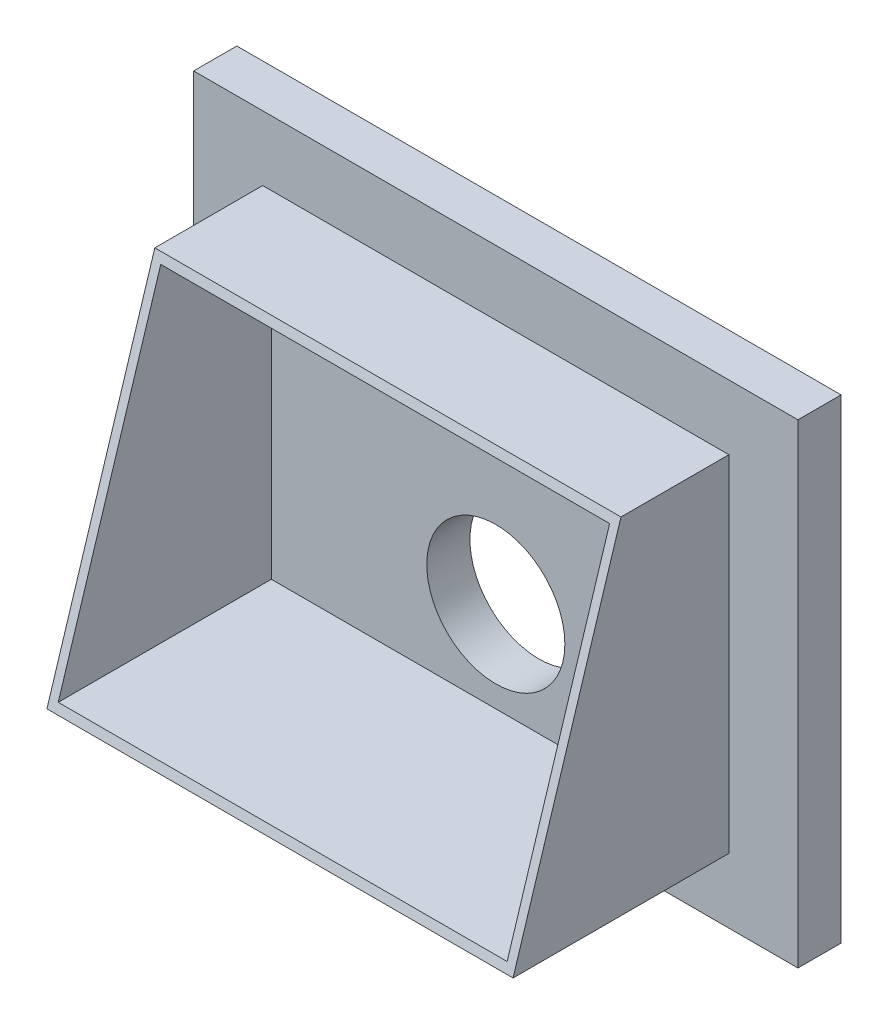
ISO-10303-21;
HEADER;
FILE_DESCRIPTION(('STEP AP214'),'2;1');
FILE_NAME('part.step','',(''),(''),'','','');
FILE_SCHEMA(('AUTOMOTIVE_DESIGN { 1 0 10303 214 1 1 1 1 }'));
ENDSEC;
DATA;
#1=APPLICATION_CONTEXT('core data for automotive mechanical design processes');
#2=APPLICATION_PROTOCOL_DEFINITION('international standard','automotive_design',2000,#1);
#3=PRODUCT_CONTEXT('',#1,'mechanical');
#4=PRODUCT('Part','Part','',(#3));
#5=PRODUCT_RELATED_PRODUCT_CATEGORY('part','',(#4));
#6=PRODUCT_DEFINITION_FORMATION('','',#4);
#7=PRODUCT_DEFINITION_CONTEXT('part definition',#1,'design');
#8=PRODUCT_DEFINITION('design','',#6,#7);
#9=PRODUCT_DEFINITION_SHAPE('','',#8);
#10=(LENGTH_UNIT() NAMED_UNIT(*) SI_UNIT(.MILLI.,.METRE.));
#11=(NAMED_UNIT(*) PLANE_ANGLE_UNIT() SI_UNIT($,.RADIAN.));
#12=(NAMED_UNIT(*) SI_UNIT($,.STERADIAN.) SOLID_ANGLE_UNIT());
#13=UNCERTAINTY_MEASURE_WITH_UNIT(LENGTH_MEASURE(1.E-05),#10,'distance_accuracy_value','');
#14=(GEOMETRIC_REPRESENTATION_CONTEXT(3) GLOBAL_UNCERTAINTY_ASSIGNED_CONTEXT((#13)) GLOBAL_UNIT_ASSIGNED_CONTEXT((#10,
#11,#12)) REPRESENTATION_CONTEXT('',''));
#15=CARTESIAN_POINT('',(0.,0.,0.));
#16=DIRECTION('',(0.,0.,1.));
#17=DIRECTION('',(1.,0.,0.));
#18=AXIS2_PLACEMENT_3D('',#15,#16,#17);
#19=CARTESIAN_POINT('',(0.,0.,50.));
#20=DIRECTION('',(0.,0.,-1.));
#21=DIRECTION('',(-1.,0.,0.));
#22=AXIS2_PLACEMENT_3D('',#19,#20,#21);
#23=PLANE('',#22);
#24=DIRECTION('',(0.,1.,0.));
#25=VECTOR('',#24,1.);
#26=CARTESIAN_POINT('',(350.,-275.,50.));
#27=LINE('',#26,#25);
#28=CARTESIAN_POINT('',(350.,-275.,50.));
#29=VERTEX_POINT('',#28);
#30=CARTESIAN_POINT('',(350.,275.,50.));
#31=VERTEX_POINT('',#30);
#32=EDGE_CURVE('E188',#29,#31,#27,.T.);
#33=ORIENTED_EDGE('',*,*,#32,.T.);
#34=DIRECTION('',(-1.,0.,0.));
#35=VECTOR('',#34,1.);
#36=CARTESIAN_POINT('',(-350.,275.,50.));
#37=LINE('',#36,#35);
#38=CARTESIAN_POINT('',(-350.,275.,50.));
#39=VERTEX_POINT('',#38);
#40=EDGE_CURVE('E192',#31,#39,#37,.T.);
#41=ORIENTED_EDGE('',*,*,#40,.T.);
#42=DIRECTION('',(0.,-1.,0.));
#43=VECTOR('',#42,1.);
#44=CARTESIAN_POINT('',(-350.,-275.,50.));
#45=LINE('',#44,#43);
#46=CARTESIAN_POINT('',(-350.,-275.,50.));
#47=VERTEX_POINT('',#46);
#48=EDGE_CURVE('E196',#39,#47,#45,.T.);
#49=ORIENTED_EDGE('',*,*,#48,.T.);
#50=DIRECTION('',(1.,0.,0.));
#51=VECTOR('',#50,1.);
#52=CARTESIAN_POINT('',(-350.,-275.,50.));
#53=LINE('',#52,#51);
#54=EDGE_CURVE('E199',#47,#29,#53,.T.);
#55=ORIENTED_EDGE('',*,*,#54,.T.);
#56=EDGE_LOOP('',(#33,#41,#49,#55));
#57=FACE_BOUND('',#56,.T.);
#58=DIRECTION('',(0.,1.,0.));
#59=VECTOR('',#58,1.);
#60=CARTESIAN_POINT('',(270.,-200.,50.));
#61=LINE('',#60,#59);
#62=CARTESIAN_POINT('',(270.,-200.,50.));
#63=VERTEX_POINT('',#62);
#64=CARTESIAN_POINT('',(270.,200.,50.));
#65=VERTEX_POINT('',#64);
#66=EDGE_CURVE('E251',#63,#65,#61,.T.);
#67=ORIENTED_EDGE('',*,*,#66,.F.);
#68=DIRECTION('',(1.,0.,0.));
#69=VECTOR('',#68,1.);
#70=CARTESIAN_POINT('',(-270.,-200.,50.));
#71=LINE('',#70,#69);
#72=CARTESIAN_POINT('',(-270.,-200.,50.));
#73=VERTEX_POINT('',#72);
#74=EDGE_CURVE('E253',#73,#63,#71,.T.);
#75=ORIENTED_EDGE('',*,*,#74,.F.);
#76=DIRECTION('',(0.,-1.,0.));
#77=VECTOR('',#76,1.);
#78=CARTESIAN_POINT('',(-270.,-200.,50.));
#79=LINE('',#78,#77);
#80=CARTESIAN_POINT('',(-270.,200.,50.));
#81=VERTEX_POINT('',#80);
#82=EDGE_CURVE('E264',#81,#73,#79,.T.);
#83=ORIENTED_EDGE('',*,*,#82,.F.);
#84=DIRECTION('',(-1.,0.,0.));
#85=VECTOR('',#84,1.);
#86=CARTESIAN_POINT('',(-270.,200.,50.));
#87=LINE('',#86,#85);
#88=EDGE_CURVE('E177',#65,#81,#87,.T.);
#89=ORIENTED_EDGE('',*,*,#88,.F.);
#90=EDGE_LOOP('',(#67,#75,#83,#89));
#91=FACE_BOUND('',#90,.T.);
#92=ADVANCED_FACE('F65',(#57,#91),#23,.F.);
#93=CARTESIAN_POINT('',(350.,-275.,50.));
#94=DIRECTION('',(-1.,0.,0.));
#95=DIRECTION('',(0.,0.,1.));
#96=AXIS2_PLACEMENT_3D('',#93,#94,#95);
#97=PLANE('',#96);
#98=DIRECTION('',(0.,1.,0.));
#99=VECTOR('',#98,1.);
#100=CARTESIAN_POINT('',(350.,-275.,0.));
#101=LINE('',#100,#99);
#102=CARTESIAN_POINT('',(350.,-275.,0.));
#103=VERTEX_POINT('',#102);
#104=CARTESIAN_POINT('',(350.,275.,0.));
#105=VERTEX_POINT('',#104);
#106=EDGE_CURVE('E182',#103,#105,#101,.T.);
#107=ORIENTED_EDGE('',*,*,#106,.T.);
#108=DIRECTION('',(0.,0.,-1.));
#109=VECTOR('',#108,1.);
#110=CARTESIAN_POINT('',(350.,275.,50.));
#111=LINE('',#110,#109);
#112=EDGE_CURVE('E74',#31,#105,#111,.T.);
#113=ORIENTED_EDGE('',*,*,#112,.F.);
#114=ORIENTED_EDGE('',*,*,#32,.F.);
#115=DIRECTION('',(0.,0.,-1.));
#116=VECTOR('',#115,1.);
#117=CARTESIAN_POINT('',(350.,-275.,50.));
#118=LINE('',#117,#116);
#119=EDGE_CURVE('E202',#29,#103,#118,.T.);
#120=ORIENTED_EDGE('',*,*,#119,.T.);
#121=EDGE_LOOP('',(#107,#113,#114,#120));
#122=FACE_BOUND('',#121,.T.);
#123=ADVANCED_FACE('F67',(#122),#97,.F.);
#124=CARTESIAN_POINT('',(-350.,275.,50.));
#125=DIRECTION('',(0.,-1.,0.));
#126=DIRECTION('',(0.,0.,-1.));
#127=AXIS2_PLACEMENT_3D('',#124,#125,#126);
#128=PLANE('',#127);
#129=DIRECTION('',(-1.,0.,0.));
#130=VECTOR('',#129,1.);
#131=CARTESIAN_POINT('',(-350.,275.,0.));
#132=LINE('',#131,#130);
#133=CARTESIAN_POINT('',(-350.,275.,0.));
#134=VERTEX_POINT('',#133);
#135=EDGE_CURVE('E206',#105,#134,#132,.T.);
#136=ORIENTED_EDGE('',*,*,#135,.T.);
#137=DIRECTION('',(0.,0.,-1.));
#138=VECTOR('',#137,1.);
#139=CARTESIAN_POINT('',(-350.,275.,50.));
#140=LINE('',#139,#138);
#141=EDGE_CURVE('E221',#39,#134,#140,.T.);
#142=ORIENTED_EDGE('',*,*,#141,.F.);
#143=ORIENTED_EDGE('',*,*,#40,.F.);
#144=ORIENTED_EDGE('',*,*,#112,.T.);
#145=EDGE_LOOP('',(#136,#142,#143,#144));
#146=FACE_BOUND('',#145,.T.);
#147=ADVANCED_FACE('F228',(#146),#128,.F.);
#148=CARTESIAN_POINT('',(-350.,-275.,50.));
#149=DIRECTION('',(1.,0.,0.));
#150=DIRECTION('',(0.,0.,-1.));
#151=AXIS2_PLACEMENT_3D('',#148,#149,#150);
#152=PLANE('',#151);
#153=DIRECTION('',(0.,-1.,0.));
#154=VECTOR('',#153,1.);
#155=CARTESIAN_POINT('',(-350.,-275.,0.));
#156=LINE('',#155,#154);
#157=CARTESIAN_POINT('',(-350.,-275.,0.));
#158=VERTEX_POINT('',#157);
#159=EDGE_CURVE('E209',#134,#158,#156,.T.);
#160=ORIENTED_EDGE('',*,*,#159,.T.);
#161=DIRECTION('',(0.,0.,-1.));
#162=VECTOR('',#161,1.);
#163=CARTESIAN_POINT('',(-350.,-275.,50.));
#164=LINE('',#163,#162);
#165=EDGE_CURVE('E217',#47,#158,#164,.T.);
#166=ORIENTED_EDGE('',*,*,#165,.F.);
#167=ORIENTED_EDGE('',*,*,#48,.F.);
#168=ORIENTED_EDGE('',*,*,#141,.T.);
#169=EDGE_LOOP('',(#160,#166,#167,#168));
#170=FACE_BOUND('',#169,.T.);
#171=ADVANCED_FACE('F240',(#170),#152,.F.);
#172=CARTESIAN_POINT('',(-350.,-275.,50.));
#173=DIRECTION('',(0.,1.,0.));
#174=DIRECTION('',(0.,0.,1.));
#175=AXIS2_PLACEMENT_3D('',#172,#173,#174);
#176=PLANE('',#175);
#177=DIRECTION('',(1.,0.,0.));
#178=VECTOR('',#177,1.);
#179=CARTESIAN_POINT('',(-350.,-275.,0.));
#180=LINE('',#179,#178);
#181=EDGE_CURVE('E193',#158,#103,#180,.T.);
#182=ORIENTED_EDGE('',*,*,#181,.T.);
#183=ORIENTED_EDGE('',*,*,#119,.F.);
#184=ORIENTED_EDGE('',*,*,#54,.F.);
#185=ORIENTED_EDGE('',*,*,#165,.T.);
#186=EDGE_LOOP('',(#182,#183,#184,#185));
#187=FACE_BOUND('',#186,.T.);
#188=ADVANCED_FACE('F244',(#187),#176,.F.);
#189=CARTESIAN_POINT('',(0.,0.,0.));
#190=DIRECTION('',(0.,0.,-1.));
#191=DIRECTION('',(-1.,0.,0.));
#192=AXIS2_PLACEMENT_3D('',#189,#190,#191);
#193=PLANE('',#192);
#194=CARTESIAN_POINT('',(0.,-85.,0.));
#195=DIRECTION('',(0.,0.,1.));
#196=DIRECTION('',(1.,0.,0.));
#197=AXIS2_PLACEMENT_3D('',#194,#195,#196);
#198=CIRCLE('',#197,80.);
#199=CARTESIAN_POINT('',(80.,-85.,0.));
#200=VERTEX_POINT('',#199);
#201=EDGE_CURVE('E174',#200,#200,#198,.T.);
#202=ORIENTED_EDGE('',*,*,#201,.T.);
#203=EDGE_LOOP('',(#202));
#204=FACE_BOUND('',#203,.T.);
#205=ORIENTED_EDGE('',*,*,#106,.F.);
#206=ORIENTED_EDGE('',*,*,#181,.F.);
#207=ORIENTED_EDGE('',*,*,#159,.F.);
#208=ORIENTED_EDGE('',*,*,#135,.F.);
#209=EDGE_LOOP('',(#205,#206,#207,#208));
#210=FACE_BOUND('',#209,.T.);
#211=ADVANCED_FACE('F236',(#204,#210),#193,.T.);
#212=CARTESIAN_POINT('',(270.,-200.,300.));
#213=DIRECTION('',(-1.,0.,0.));
#214=DIRECTION('',(0.,0.,1.));
#215=AXIS2_PLACEMENT_3D('',#212,#213,#214);
#216=PLANE('',#215);
#217=DIRECTION('',(0.,0.,-1.));
#218=VECTOR('',#217,1.);
#219=CARTESIAN_POINT('',(270.,200.,300.));
#220=LINE('',#219,#218);
#221=CARTESIAN_POINT('',(270.,200.,175.));
#222=VERTEX_POINT('',#221);
#223=EDGE_CURVE('E88',#222,#65,#220,.T.);
#224=ORIENTED_EDGE('',*,*,#223,.F.);
#225=DIRECTION('',(0.,-0.95447997803503,0.298274993135947));
#226=VECTOR('',#225,1.);
#227=CARTESIAN_POINT('',(270.,-200.,300.));
#228=LINE('',#227,#226);
#229=CARTESIAN_POINT('',(270.,-200.,300.));
#230=VERTEX_POINT('',#229);
#231=EDGE_CURVE('E160',#222,#230,#228,.T.);
#232=ORIENTED_EDGE('',*,*,#231,.T.);
#233=DIRECTION('',(0.,0.,-1.));
#234=VECTOR('',#233,1.);
#235=CARTESIAN_POINT('',(270.,-200.,300.));
#236=LINE('',#235,#234);
#237=EDGE_CURVE('E184',#230,#63,#236,.T.);
#238=ORIENTED_EDGE('',*,*,#237,.T.);
#239=ORIENTED_EDGE('',*,*,#66,.T.);
#240=EDGE_LOOP('',(#224,#232,#238,#239));
#241=FACE_BOUND('',#240,.T.);
#242=ADVANCED_FACE('F266',(#241),#216,.F.);
#243=CARTESIAN_POINT('',(-270.,200.,300.));
#244=DIRECTION('',(0.,-1.,0.));
#245=DIRECTION('',(0.,0.,-1.));
#246=AXIS2_PLACEMENT_3D('',#243,#244,#245);
#247=PLANE('',#246);
#248=DIRECTION('',(0.,0.,-1.));
#249=VECTOR('',#248,1.);
#250=CARTESIAN_POINT('',(-270.,200.,300.));
#251=LINE('',#250,#249);
#252=CARTESIAN_POINT('',(-270.,200.,175.));
#253=VERTEX_POINT('',#252);
#254=EDGE_CURVE('E168',#253,#81,#251,.T.);
#255=ORIENTED_EDGE('',*,*,#254,.F.);
#256=DIRECTION('',(-1.,0.,0.));
#257=VECTOR('',#256,1.);
#258=CARTESIAN_POINT('',(350.,200.,175.));
#259=LINE('',#258,#257);
#260=EDGE_CURVE('E154',#222,#253,#259,.T.);
#261=ORIENTED_EDGE('',*,*,#260,.F.);
#262=ORIENTED_EDGE('',*,*,#223,.T.);
#263=ORIENTED_EDGE('',*,*,#88,.T.);
#264=EDGE_LOOP('',(#255,#261,#262,#263));
#265=FACE_BOUND('',#264,.T.);
#266=ADVANCED_FACE('F176',(#265),#247,.F.);
#267=CARTESIAN_POINT('',(-270.,-200.,300.));
#268=DIRECTION('',(1.,0.,0.));
#269=DIRECTION('',(0.,0.,-1.));
#270=AXIS2_PLACEMENT_3D('',#267,#268,#269);
#271=PLANE('',#270);
#272=DIRECTION('',(0.,0.,-1.));
#273=VECTOR('',#272,1.);
#274=CARTESIAN_POINT('',(-270.,-200.,300.));
#275=LINE('',#274,#273);
#276=CARTESIAN_POINT('',(-270.,-200.,300.));
#277=VERTEX_POINT('',#276);
#278=EDGE_CURVE('E171',#277,#73,#275,.T.);
#279=ORIENTED_EDGE('',*,*,#278,.F.);
#280=DIRECTION('',(0.,-0.95447997803503,0.298274993135947));
#281=VECTOR('',#280,1.);
#282=CARTESIAN_POINT('',(-270.,200.,175.));
#283=LINE('',#282,#281);
#284=EDGE_CURVE('E157',#253,#277,#283,.T.);
#285=ORIENTED_EDGE('',*,*,#284,.F.);
#286=ORIENTED_EDGE('',*,*,#254,.T.);
#287=ORIENTED_EDGE('',*,*,#82,.T.);
#288=EDGE_LOOP('',(#279,#285,#286,#287));
#289=FACE_BOUND('',#288,.T.);
#290=ADVANCED_FACE('F166',(#289),#271,.F.);
#291=CARTESIAN_POINT('',(-270.,-200.,300.));
#292=DIRECTION('',(0.,1.,0.));
#293=DIRECTION('',(0.,0.,1.));
#294=AXIS2_PLACEMENT_3D('',#291,#292,#293);
#295=PLANE('',#294);
#296=ORIENTED_EDGE('',*,*,#74,.T.);
#297=ORIENTED_EDGE('',*,*,#237,.F.);
#298=DIRECTION('',(1.,0.,0.));
#299=VECTOR('',#298,1.);
#300=CARTESIAN_POINT('',(-270.,-200.,300.));
#301=LINE('',#300,#299);
#302=EDGE_CURVE('E263',#277,#230,#301,.T.);
#303=ORIENTED_EDGE('',*,*,#302,.F.);
#304=ORIENTED_EDGE('',*,*,#278,.T.);
#305=EDGE_LOOP('',(#296,#297,#303,#304));
#306=FACE_BOUND('',#305,.T.);
#307=ADVANCED_FACE('F261',(#306),#295,.F.);
#308=CARTESIAN_POINT('',(350.,200.,175.));
#309=DIRECTION('',(0.,-0.298274993135947,-0.95447997803503));
#310=DIRECTION('',(0.,0.95447997803503,-0.298274993135947));
#311=AXIS2_PLACEMENT_3D('',#308,#309,#310);
#312=PLANE('',#311);
#313=DIRECTION('',(0.,-0.95447997803503,0.298274993135947));
#314=VECTOR('',#313,1.);
#315=CARTESIAN_POINT('',(260.,-17.7935943060498,243.060498220641));
#316=LINE('',#315,#314);
#317=CARTESIAN_POINT('',(260.,190.,178.125));
#318=VERTEX_POINT('',#317);
#319=CARTESIAN_POINT('',(260.,-190.,296.875));
#320=VERTEX_POINT('',#319);
#321=EDGE_CURVE('E80',#318,#320,#316,.T.);
#322=ORIENTED_EDGE('',*,*,#321,.T.);
#323=DIRECTION('',(-1.,0.,0.));
#324=VECTOR('',#323,1.);
#325=CARTESIAN_POINT('',(0.,-190.,296.875));
#326=LINE('',#325,#324);
#327=CARTESIAN_POINT('',(-260.,-190.,296.875));
#328=VERTEX_POINT('',#327);
#329=EDGE_CURVE('E12',#320,#328,#326,.T.);
#330=ORIENTED_EDGE('',*,*,#329,.T.);
#331=DIRECTION('',(0.,0.95447997803503,-0.298274993135947));
#332=VECTOR('',#331,1.);
#333=CARTESIAN_POINT('',(-260.,-17.7935943060498,243.060498220641));
#334=LINE('',#333,#332);
#335=CARTESIAN_POINT('',(-260.,190.,178.125));
#336=VERTEX_POINT('',#335);
#337=EDGE_CURVE('E163',#328,#336,#334,.T.);
#338=ORIENTED_EDGE('',*,*,#337,.T.);
#339=DIRECTION('',(1.,0.,0.));
#340=VECTOR('',#339,1.);
#341=CARTESIAN_POINT('',(0.,190.,178.125));
#342=LINE('',#341,#340);
#343=EDGE_CURVE('E306',#336,#318,#342,.T.);
#344=ORIENTED_EDGE('',*,*,#343,.T.);
#345=EDGE_LOOP('',(#322,#330,#338,#344));
#346=FACE_BOUND('',#345,.T.);
#347=ORIENTED_EDGE('',*,*,#260,.T.);
#348=ORIENTED_EDGE('',*,*,#284,.T.);
#349=ORIENTED_EDGE('',*,*,#302,.T.);
#350=ORIENTED_EDGE('',*,*,#231,.F.);
#351=EDGE_LOOP('',(#347,#348,#349,#350));
#352=FACE_BOUND('',#351,.T.);
#353=ADVANCED_FACE('F156',(#346,#352),#312,.F.);
#354=CARTESIAN_POINT('',(0.,-85.,50.));
#355=DIRECTION('',(0.,0.,1.));
#356=DIRECTION('',(1.,0.,0.));
#357=AXIS2_PLACEMENT_3D('',#354,#355,#356);
#358=CIRCLE('',#357,80.);
#359=CARTESIAN_POINT('',(80.,-85.,50.));
#360=VERTEX_POINT('',#359);
#361=EDGE_CURVE('E311',#360,#360,#358,.T.);
#362=ORIENTED_EDGE('',*,*,#361,.F.);
#363=EDGE_LOOP('',(#362));
#364=FACE_BOUND('',#363,.T.);
#365=DIRECTION('',(1.,0.,0.));
#366=VECTOR('',#365,1.);
#367=CARTESIAN_POINT('',(0.,-190.,50.));
#368=LINE('',#367,#366);
#369=CARTESIAN_POINT('',(-260.,-190.,50.));
#370=VERTEX_POINT('',#369);
#371=CARTESIAN_POINT('',(260.,-190.,50.));
#372=VERTEX_POINT('',#371);
#373=EDGE_CURVE('E286',#370,#372,#368,.T.);
#374=ORIENTED_EDGE('',*,*,#373,.T.);
#375=DIRECTION('',(0.,1.,0.));
#376=VECTOR('',#375,1.);
#377=CARTESIAN_POINT('',(260.,0.,50.));
#378=LINE('',#377,#376);
#379=CARTESIAN_POINT('',(260.,190.,50.));
#380=VERTEX_POINT('',#379);
#381=EDGE_CURVE('E298',#372,#380,#378,.T.);
#382=ORIENTED_EDGE('',*,*,#381,.T.);
#383=DIRECTION('',(-1.,0.,0.));
#384=VECTOR('',#383,1.);
#385=CARTESIAN_POINT('',(0.,190.,50.));
#386=LINE('',#385,#384);
#387=CARTESIAN_POINT('',(-260.,190.,50.));
#388=VERTEX_POINT('',#387);
#389=EDGE_CURVE('E294',#380,#388,#386,.T.);
#390=ORIENTED_EDGE('',*,*,#389,.T.);
#391=DIRECTION('',(0.,-1.,0.));
#392=VECTOR('',#391,1.);
#393=CARTESIAN_POINT('',(-260.,0.,50.));
#394=LINE('',#393,#392);
#395=EDGE_CURVE('E290',#388,#370,#394,.T.);
#396=ORIENTED_EDGE('',*,*,#395,.T.);
#397=EDGE_LOOP('',(#374,#382,#390,#396));
#398=FACE_BOUND('',#397,.T.);
#399=ADVANCED_FACE('F249',(#364,#398),#23,.F.);
#400=CARTESIAN_POINT('',(0.,-190.,300.));
#401=DIRECTION('',(0.,1.,0.));
#402=DIRECTION('',(0.,0.,1.));
#403=AXIS2_PLACEMENT_3D('',#400,#401,#402);
#404=PLANE('',#403);
#405=ORIENTED_EDGE('',*,*,#329,.F.);
#406=DIRECTION('',(0.,0.,-1.));
#407=VECTOR('',#406,1.);
#408=CARTESIAN_POINT('',(260.,-190.,300.));
#409=LINE('',#408,#407);
#410=EDGE_CURVE('E283',#320,#372,#409,.T.);
#411=ORIENTED_EDGE('',*,*,#410,.T.);
#412=ORIENTED_EDGE('',*,*,#373,.F.);
#413=DIRECTION('',(0.,0.,-1.));
#414=VECTOR('',#413,1.);
#415=CARTESIAN_POINT('',(-260.,-190.,300.));
#416=LINE('',#415,#414);
#417=EDGE_CURVE('E280',#328,#370,#416,.T.);
#418=ORIENTED_EDGE('',*,*,#417,.F.);
#419=EDGE_LOOP('',(#405,#411,#412,#418));
#420=FACE_BOUND('',#419,.T.);
#421=ADVANCED_FACE('F329',(#420),#404,.T.);
#422=CARTESIAN_POINT('',(-260.,0.,300.));
#423=DIRECTION('',(1.,0.,0.));
#424=DIRECTION('',(0.,0.,-1.));
#425=AXIS2_PLACEMENT_3D('',#422,#423,#424);
#426=PLANE('',#425);
#427=ORIENTED_EDGE('',*,*,#337,.F.);
#428=ORIENTED_EDGE('',*,*,#417,.T.);
#429=ORIENTED_EDGE('',*,*,#395,.F.);
#430=DIRECTION('',(0.,0.,-1.));
#431=VECTOR('',#430,1.);
#432=CARTESIAN_POINT('',(-260.,190.,300.));
#433=LINE('',#432,#431);
#434=EDGE_CURVE('E277',#336,#388,#433,.T.);
#435=ORIENTED_EDGE('',*,*,#434,.F.);
#436=EDGE_LOOP('',(#427,#428,#429,#435));
#437=FACE_BOUND('',#436,.T.);
#438=ADVANCED_FACE('F345',(#437),#426,.T.);
#439=CARTESIAN_POINT('',(0.,190.,300.));
#440=DIRECTION('',(0.,-1.,0.));
#441=DIRECTION('',(0.,0.,-1.));
#442=AXIS2_PLACEMENT_3D('',#439,#440,#441);
#443=PLANE('',#442);
#444=ORIENTED_EDGE('',*,*,#343,.F.);
#445=ORIENTED_EDGE('',*,*,#434,.T.);
#446=ORIENTED_EDGE('',*,*,#389,.F.);
#447=DIRECTION('',(0.,0.,-1.));
#448=VECTOR('',#447,1.);
#449=CARTESIAN_POINT('',(260.,190.,300.));
#450=LINE('',#449,#448);
#451=EDGE_CURVE('E257',#318,#380,#450,.T.);
#452=ORIENTED_EDGE('',*,*,#451,.F.);
#453=EDGE_LOOP('',(#444,#445,#446,#452));
#454=FACE_BOUND('',#453,.T.);
#455=ADVANCED_FACE('F341',(#454),#443,.T.);
#456=CARTESIAN_POINT('',(260.,0.,300.));
#457=DIRECTION('',(-1.,0.,0.));
#458=DIRECTION('',(0.,0.,1.));
#459=AXIS2_PLACEMENT_3D('',#456,#457,#458);
#460=PLANE('',#459);
#461=ORIENTED_EDGE('',*,*,#321,.F.);
#462=ORIENTED_EDGE('',*,*,#451,.T.);
#463=ORIENTED_EDGE('',*,*,#381,.F.);
#464=ORIENTED_EDGE('',*,*,#410,.F.);
#465=EDGE_LOOP('',(#461,#462,#463,#464));
#466=FACE_BOUND('',#465,.T.);
#467=ADVANCED_FACE('F323',(#466),#460,.T.);
#468=CARTESIAN_POINT('',(0.,-85.,0.));
#469=DIRECTION('',(0.,0.,1.));
#470=DIRECTION('',(1.,0.,0.));
#471=AXIS2_PLACEMENT_3D('',#468,#469,#470);
#472=CYLINDRICAL_SURFACE('',#471,80.);
#473=ORIENTED_EDGE('',*,*,#201,.F.);
#474=EDGE_LOOP('',(#473));
#475=FACE_BOUND('',#474,.T.);
#476=ORIENTED_EDGE('',*,*,#361,.T.);
#477=EDGE_LOOP('',(#476));
#478=FACE_BOUND('',#477,.T.);
#479=ADVANCED_FACE('F320',(#475,#478),#472,.F.);
#480=CLOSED_SHELL('',(#92,#123,#147,#171,#188,#211,#242,#266,#290,#307,#353,#399,#421,#438,#455,
#467,#479));
#481=MANIFOLD_SOLID_BREP('B2',#480);
#482=ADVANCED_BREP_SHAPE_REPRESENTATION('',(#18,#481),#14);
#483=SHAPE_DEFINITION_REPRESENTATION(#9,#482);
ENDSEC;
END-ISO-10303-21;
